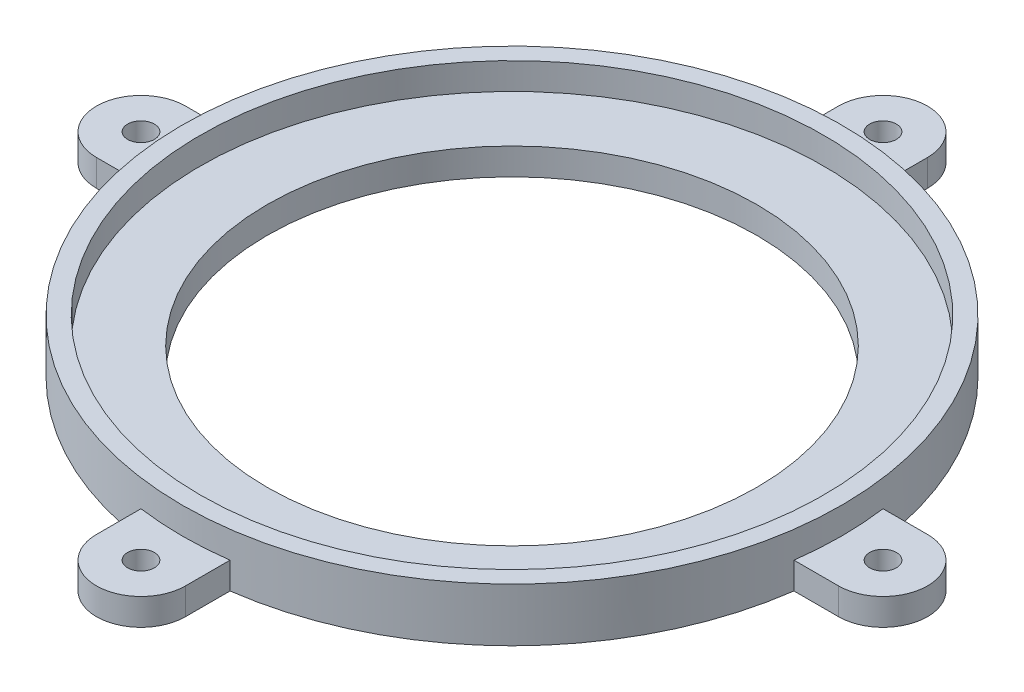
ISO-10303-21;
HEADER;
FILE_DESCRIPTION(('STEP AP214'),'2;1');
FILE_NAME('part.step','',(''),(''),'','','');
FILE_SCHEMA(('AUTOMOTIVE_DESIGN { 1 0 10303 214 1 1 1 1 }'));
ENDSEC;
DATA;
#1=APPLICATION_CONTEXT('core data for automotive mechanical design processes');
#2=APPLICATION_PROTOCOL_DEFINITION('international standard','automotive_design',2000,#1);
#3=PRODUCT_CONTEXT('',#1,'mechanical');
#4=PRODUCT('Part','Part','',(#3));
#5=PRODUCT_RELATED_PRODUCT_CATEGORY('part','',(#4));
#6=PRODUCT_DEFINITION_FORMATION('','',#4);
#7=PRODUCT_DEFINITION_CONTEXT('part definition',#1,'design');
#8=PRODUCT_DEFINITION('design','',#6,#7);
#9=PRODUCT_DEFINITION_SHAPE('','',#8);
#10=(LENGTH_UNIT() NAMED_UNIT(*) SI_UNIT(.MILLI.,.METRE.));
#11=(NAMED_UNIT(*) PLANE_ANGLE_UNIT() SI_UNIT($,.RADIAN.));
#12=(NAMED_UNIT(*) SI_UNIT($,.STERADIAN.) SOLID_ANGLE_UNIT());
#13=UNCERTAINTY_MEASURE_WITH_UNIT(LENGTH_MEASURE(1.E-05),#10,'distance_accuracy_value','');
#14=(GEOMETRIC_REPRESENTATION_CONTEXT(3) GLOBAL_UNCERTAINTY_ASSIGNED_CONTEXT((#13)) GLOBAL_UNIT_ASSIGNED_CONTEXT((#10,
#11,#12)) REPRESENTATION_CONTEXT('',''));
#15=CARTESIAN_POINT('',(0.,0.,0.));
#16=DIRECTION('',(0.,0.,1.));
#17=DIRECTION('',(1.,0.,0.));
#18=AXIS2_PLACEMENT_3D('',#15,#16,#17);
#19=CARTESIAN_POINT('',(0.,3.81,0.));
#20=DIRECTION('',(0.,1.,0.));
#21=DIRECTION('',(0.,0.,1.));
#22=AXIS2_PLACEMENT_3D('',#19,#20,#21);
#23=PLANE('',#22);
#24=CARTESIAN_POINT('',(0.,3.81,0.));
#25=DIRECTION('',(0.,1.,0.));
#26=DIRECTION('',(0.,0.,1.));
#27=AXIS2_PLACEMENT_3D('',#24,#25,#26);
#28=CIRCLE('',#27,46.99);
#29=CARTESIAN_POINT('',(46.5589690607513,3.81,6.35));
#30=VERTEX_POINT('',#29);
#31=CARTESIAN_POINT('',(46.5589690607513,3.81,-6.35));
#32=VERTEX_POINT('',#31);
#33=EDGE_CURVE('E11',#30,#32,#28,.T.);
#34=ORIENTED_EDGE('',*,*,#33,.F.);
#35=DIRECTION('',(1.,0.,0.));
#36=VECTOR('',#35,1.);
#37=CARTESIAN_POINT('',(46.5589690607513,3.81,6.35));
#38=LINE('',#37,#36);
#39=CARTESIAN_POINT('',(52.9089690607513,3.81,6.35));
#40=VERTEX_POINT('',#39);
#41=EDGE_CURVE('E156',#30,#40,#38,.T.);
#42=ORIENTED_EDGE('',*,*,#41,.T.);
#43=CARTESIAN_POINT('',(52.9089690607513,3.81,0.));
#44=DIRECTION('',(0.,1.,0.));
#45=DIRECTION('',(0.,0.,-1.));
#46=AXIS2_PLACEMENT_3D('',#43,#44,#45);
#47=CIRCLE('',#46,6.35);
#48=CARTESIAN_POINT('',(52.9089690607513,3.81,-6.35));
#49=VERTEX_POINT('',#48);
#50=EDGE_CURVE('E160',#40,#49,#47,.T.);
#51=ORIENTED_EDGE('',*,*,#50,.T.);
#52=DIRECTION('',(-1.,0.,0.));
#53=VECTOR('',#52,1.);
#54=CARTESIAN_POINT('',(46.5589690607513,3.81,-6.35));
#55=LINE('',#54,#53);
#56=EDGE_CURVE('E54',#49,#32,#55,.T.);
#57=ORIENTED_EDGE('',*,*,#56,.T.);
#58=EDGE_LOOP('',(#34,#42,#51,#57));
#59=FACE_BOUND('',#58,.T.);
#60=CARTESIAN_POINT('',(52.9089690607513,3.81,0.));
#61=DIRECTION('',(0.,1.,0.));
#62=DIRECTION('',(0.,0.,1.));
#63=AXIS2_PLACEMENT_3D('',#60,#61,#62);
#64=CIRCLE('',#63,1.905);
#65=CARTESIAN_POINT('',(52.9089690607513,3.81,1.905));
#66=VERTEX_POINT('',#65);
#67=EDGE_CURVE('E184',#66,#66,#64,.T.);
#68=ORIENTED_EDGE('',*,*,#67,.F.);
#69=EDGE_LOOP('',(#68));
#70=FACE_BOUND('',#69,.T.);
#71=ADVANCED_FACE('F35',(#59,#70),#23,.T.);
#72=CARTESIAN_POINT('',(6.34999999999999,3.81,-46.5589690607513));
#73=VERTEX_POINT('',#72);
#74=CARTESIAN_POINT('',(-6.35,3.81,-46.5589690607513));
#75=VERTEX_POINT('',#74);
#76=EDGE_CURVE('E45',#73,#75,#28,.T.);
#77=ORIENTED_EDGE('',*,*,#76,.F.);
#78=DIRECTION('',(0.,0.,-1.));
#79=VECTOR('',#78,1.);
#80=CARTESIAN_POINT('',(6.34999999999999,3.81,-46.5589690607513));
#81=LINE('',#80,#79);
#82=CARTESIAN_POINT('',(6.34999999999999,3.81,-52.9089690607513));
#83=VERTEX_POINT('',#82);
#84=EDGE_CURVE('E211',#73,#83,#81,.T.);
#85=ORIENTED_EDGE('',*,*,#84,.T.);
#86=CARTESIAN_POINT('',(0.,3.81,-52.9089690607513));
#87=DIRECTION('',(0.,1.,0.));
#88=DIRECTION('',(0.,0.,-1.));
#89=AXIS2_PLACEMENT_3D('',#86,#87,#88);
#90=CIRCLE('',#89,6.35);
#91=CARTESIAN_POINT('',(-6.35000000000001,3.81,-52.9089690607513));
#92=VERTEX_POINT('',#91);
#93=EDGE_CURVE('E276',#83,#92,#90,.T.);
#94=ORIENTED_EDGE('',*,*,#93,.T.);
#95=DIRECTION('',(0.,0.,1.));
#96=VECTOR('',#95,1.);
#97=CARTESIAN_POINT('',(-6.35000000000001,3.81,-46.5589690607513));
#98=LINE('',#97,#96);
#99=EDGE_CURVE('E272',#92,#75,#98,.T.);
#100=ORIENTED_EDGE('',*,*,#99,.T.);
#101=EDGE_LOOP('',(#77,#85,#94,#100));
#102=FACE_BOUND('',#101,.T.);
#103=CARTESIAN_POINT('',(0.,3.81,-52.9089690607513));
#104=DIRECTION('',(0.,1.,0.));
#105=DIRECTION('',(0.,0.,1.));
#106=AXIS2_PLACEMENT_3D('',#103,#104,#105);
#107=CIRCLE('',#106,1.90499999999984);
#108=CARTESIAN_POINT('',(0.,3.81,-51.0039690607515));
#109=VERTEX_POINT('',#108);
#110=EDGE_CURVE('E376',#109,#109,#107,.T.);
#111=ORIENTED_EDGE('',*,*,#110,.F.);
#112=EDGE_LOOP('',(#111));
#113=FACE_BOUND('',#112,.T.);
#114=ADVANCED_FACE('F370',(#102,#113),#23,.T.);
#115=CARTESIAN_POINT('',(-46.5589690607513,3.81,-6.34999999999999));
#116=VERTEX_POINT('',#115);
#117=CARTESIAN_POINT('',(-46.5589690607513,3.81,6.35000000000002));
#118=VERTEX_POINT('',#117);
#119=EDGE_CURVE('E250',#116,#118,#28,.T.);
#120=ORIENTED_EDGE('',*,*,#119,.F.);
#121=DIRECTION('',(-1.,0.,0.));
#122=VECTOR('',#121,1.);
#123=CARTESIAN_POINT('',(-46.5589690607513,3.81,-6.34999999999999));
#124=LINE('',#123,#122);
#125=CARTESIAN_POINT('',(-52.9089690607513,3.81,-6.34999999999999));
#126=VERTEX_POINT('',#125);
#127=EDGE_CURVE('E270',#116,#126,#124,.T.);
#128=ORIENTED_EDGE('',*,*,#127,.T.);
#129=CARTESIAN_POINT('',(-52.9089690607513,3.81,0.));
#130=DIRECTION('',(0.,1.,0.));
#131=DIRECTION('',(0.,0.,-1.));
#132=AXIS2_PLACEMENT_3D('',#129,#130,#131);
#133=CIRCLE('',#132,6.35);
#134=CARTESIAN_POINT('',(-52.9089690607513,3.81,6.35000000000001));
#135=VERTEX_POINT('',#134);
#136=EDGE_CURVE('E259',#126,#135,#133,.T.);
#137=ORIENTED_EDGE('',*,*,#136,.T.);
#138=DIRECTION('',(1.,0.,0.));
#139=VECTOR('',#138,1.);
#140=CARTESIAN_POINT('',(-46.5589690607513,3.81,6.35000000000001));
#141=LINE('',#140,#139);
#142=EDGE_CURVE('E256',#135,#118,#141,.T.);
#143=ORIENTED_EDGE('',*,*,#142,.T.);
#144=EDGE_LOOP('',(#120,#128,#137,#143));
#145=FACE_BOUND('',#144,.T.);
#146=CARTESIAN_POINT('',(-52.9089690607513,3.81,0.));
#147=DIRECTION('',(0.,1.,0.));
#148=DIRECTION('',(0.,0.,1.));
#149=AXIS2_PLACEMENT_3D('',#146,#147,#148);
#150=CIRCLE('',#149,1.90500000000001);
#151=CARTESIAN_POINT('',(-52.9089690607513,3.81,1.90500000000001));
#152=VERTEX_POINT('',#151);
#153=EDGE_CURVE('E382',#152,#152,#150,.T.);
#154=ORIENTED_EDGE('',*,*,#153,.F.);
#155=EDGE_LOOP('',(#154));
#156=FACE_BOUND('',#155,.T.);
#157=ADVANCED_FACE('F351',(#145,#156),#23,.T.);
#158=CARTESIAN_POINT('',(0.,3.81,0.));
#159=DIRECTION('',(0.,1.,0.));
#160=DIRECTION('',(0.,0.,1.));
#161=AXIS2_PLACEMENT_3D('',#158,#159,#160);
#162=CIRCLE('',#161,34.925);
#163=CARTESIAN_POINT('',(0.,3.81,34.925));
#164=VERTEX_POINT('',#163);
#165=EDGE_CURVE('E388',#164,#164,#162,.T.);
#166=ORIENTED_EDGE('',*,*,#165,.F.);
#167=EDGE_LOOP('',(#166));
#168=FACE_BOUND('',#167,.T.);
#169=CARTESIAN_POINT('',(0.,3.81,0.));
#170=DIRECTION('',(0.,1.,0.));
#171=DIRECTION('',(0.,0.,1.));
#172=AXIS2_PLACEMENT_3D('',#169,#170,#171);
#173=CIRCLE('',#172,44.45);
#174=CARTESIAN_POINT('',(0.,3.81,44.45));
#175=VERTEX_POINT('',#174);
#176=EDGE_CURVE('E441',#175,#175,#173,.T.);
#177=ORIENTED_EDGE('',*,*,#176,.T.);
#178=EDGE_LOOP('',(#177));
#179=FACE_BOUND('',#178,.T.);
#180=ADVANCED_FACE('F425',(#168,#179),#23,.T.);
#181=CARTESIAN_POINT('',(-6.35,3.81,46.5589690607513));
#182=VERTEX_POINT('',#181);
#183=CARTESIAN_POINT('',(6.35,3.81,46.5589690607513));
#184=VERTEX_POINT('',#183);
#185=EDGE_CURVE('E246',#182,#184,#28,.T.);
#186=ORIENTED_EDGE('',*,*,#185,.F.);
#187=DIRECTION('',(0.,0.,1.));
#188=VECTOR('',#187,1.);
#189=CARTESIAN_POINT('',(-6.35,3.81,46.5589690607513));
#190=LINE('',#189,#188);
#191=CARTESIAN_POINT('',(-6.35,3.81,52.9089690607513));
#192=VERTEX_POINT('',#191);
#193=EDGE_CURVE('E258',#182,#192,#190,.T.);
#194=ORIENTED_EDGE('',*,*,#193,.T.);
#195=CARTESIAN_POINT('',(0.,3.81,52.9089690607513));
#196=DIRECTION('',(0.,1.,0.));
#197=DIRECTION('',(0.,0.,-1.));
#198=AXIS2_PLACEMENT_3D('',#195,#196,#197);
#199=CIRCLE('',#198,6.35);
#200=CARTESIAN_POINT('',(6.35,3.81,52.9089690607513));
#201=VERTEX_POINT('',#200);
#202=EDGE_CURVE('E178',#192,#201,#199,.T.);
#203=ORIENTED_EDGE('',*,*,#202,.T.);
#204=DIRECTION('',(0.,0.,-1.));
#205=VECTOR('',#204,1.);
#206=CARTESIAN_POINT('',(6.35,3.81,46.5589690607513));
#207=LINE('',#206,#205);
#208=EDGE_CURVE('E164',#201,#184,#207,.T.);
#209=ORIENTED_EDGE('',*,*,#208,.T.);
#210=EDGE_LOOP('',(#186,#194,#203,#209));
#211=FACE_BOUND('',#210,.T.);
#212=CARTESIAN_POINT('',(0.,3.81,52.9089690607513));
#213=DIRECTION('',(0.,1.,0.));
#214=DIRECTION('',(0.,0.,1.));
#215=AXIS2_PLACEMENT_3D('',#212,#213,#214);
#216=CIRCLE('',#215,1.905);
#217=CARTESIAN_POINT('',(0.,3.81,54.8139690607513));
#218=VERTEX_POINT('',#217);
#219=EDGE_CURVE('E394',#218,#218,#216,.T.);
#220=ORIENTED_EDGE('',*,*,#219,.F.);
#221=EDGE_LOOP('',(#220));
#222=FACE_BOUND('',#221,.T.);
#223=ADVANCED_FACE('F302',(#211,#222),#23,.T.);
#224=CARTESIAN_POINT('',(0.,0.,0.));
#225=DIRECTION('',(0.,1.,0.));
#226=DIRECTION('',(0.,0.,1.));
#227=AXIS2_PLACEMENT_3D('',#224,#225,#226);
#228=PLANE('',#227);
#229=CARTESIAN_POINT('',(0.,0.,0.));
#230=DIRECTION('',(0.,1.,0.));
#231=DIRECTION('',(0.,0.,1.));
#232=AXIS2_PLACEMENT_3D('',#229,#230,#231);
#233=CIRCLE('',#232,34.925);
#234=CARTESIAN_POINT('',(0.,0.,34.925));
#235=VERTEX_POINT('',#234);
#236=EDGE_CURVE('E385',#235,#235,#233,.T.);
#237=ORIENTED_EDGE('',*,*,#236,.T.);
#238=EDGE_LOOP('',(#237));
#239=FACE_BOUND('',#238,.T.);
#240=CARTESIAN_POINT('',(0.,0.,0.));
#241=DIRECTION('',(0.,1.,0.));
#242=DIRECTION('',(0.,0.,1.));
#243=AXIS2_PLACEMENT_3D('',#240,#241,#242);
#244=CIRCLE('',#243,46.99);
#245=CARTESIAN_POINT('',(46.5589690607513,0.,-6.35));
#246=VERTEX_POINT('',#245);
#247=CARTESIAN_POINT('',(6.34999999999999,0.,-46.5589690607513));
#248=VERTEX_POINT('',#247);
#249=EDGE_CURVE('E180',#246,#248,#244,.T.);
#250=ORIENTED_EDGE('',*,*,#249,.F.);
#251=DIRECTION('',(-1.,0.,0.));
#252=VECTOR('',#251,1.);
#253=CARTESIAN_POINT('',(46.5589690607513,0.,-6.35));
#254=LINE('',#253,#252);
#255=CARTESIAN_POINT('',(52.9089690607513,0.,-6.35));
#256=VERTEX_POINT('',#255);
#257=EDGE_CURVE('E114',#256,#246,#254,.T.);
#258=ORIENTED_EDGE('',*,*,#257,.F.);
#259=CARTESIAN_POINT('',(52.9089690607513,0.,0.));
#260=DIRECTION('',(0.,1.,0.));
#261=DIRECTION('',(0.,0.,-1.));
#262=AXIS2_PLACEMENT_3D('',#259,#260,#261);
#263=CIRCLE('',#262,6.35);
#264=CARTESIAN_POINT('',(52.9089690607513,0.,6.35));
#265=VERTEX_POINT('',#264);
#266=EDGE_CURVE('E108',#265,#256,#263,.T.);
#267=ORIENTED_EDGE('',*,*,#266,.F.);
#268=DIRECTION('',(1.,0.,0.));
#269=VECTOR('',#268,1.);
#270=CARTESIAN_POINT('',(46.5589690607513,0.,6.35));
#271=LINE('',#270,#269);
#272=CARTESIAN_POINT('',(46.5589690607513,0.,6.35));
#273=VERTEX_POINT('',#272);
#274=EDGE_CURVE('E168',#273,#265,#271,.T.);
#275=ORIENTED_EDGE('',*,*,#274,.F.);
#276=CARTESIAN_POINT('',(0.,0.,0.));
#277=DIRECTION('',(0.,1.,0.));
#278=DIRECTION('',(0.,0.,1.));
#279=AXIS2_PLACEMENT_3D('',#276,#277,#278);
#280=CIRCLE('',#279,46.99);
#281=CARTESIAN_POINT('',(6.35,0.,46.5589690607513));
#282=VERTEX_POINT('',#281);
#283=EDGE_CURVE('E206',#282,#273,#280,.T.);
#284=ORIENTED_EDGE('',*,*,#283,.F.);
#285=DIRECTION('',(0.,0.,-1.));
#286=VECTOR('',#285,1.);
#287=CARTESIAN_POINT('',(6.35,0.,46.5589690607513));
#288=LINE('',#287,#286);
#289=CARTESIAN_POINT('',(6.35,0.,52.9089690607513));
#290=VERTEX_POINT('',#289);
#291=EDGE_CURVE('E204',#290,#282,#288,.T.);
#292=ORIENTED_EDGE('',*,*,#291,.F.);
#293=CARTESIAN_POINT('',(0.,0.,52.9089690607513));
#294=DIRECTION('',(0.,1.,0.));
#295=DIRECTION('',(0.,0.,-1.));
#296=AXIS2_PLACEMENT_3D('',#293,#294,#295);
#297=CIRCLE('',#296,6.35);
#298=CARTESIAN_POINT('',(-6.35,0.,52.9089690607513));
#299=VERTEX_POINT('',#298);
#300=EDGE_CURVE('E202',#299,#290,#297,.T.);
#301=ORIENTED_EDGE('',*,*,#300,.F.);
#302=DIRECTION('',(0.,0.,1.));
#303=VECTOR('',#302,1.);
#304=CARTESIAN_POINT('',(-6.35,0.,46.5589690607513));
#305=LINE('',#304,#303);
#306=CARTESIAN_POINT('',(-6.35,0.,46.5589690607513));
#307=VERTEX_POINT('',#306);
#308=EDGE_CURVE('E200',#307,#299,#305,.T.);
#309=ORIENTED_EDGE('',*,*,#308,.F.);
#310=CARTESIAN_POINT('',(0.,0.,0.));
#311=DIRECTION('',(0.,1.,0.));
#312=DIRECTION('',(0.,0.,1.));
#313=AXIS2_PLACEMENT_3D('',#310,#311,#312);
#314=CIRCLE('',#313,46.99);
#315=CARTESIAN_POINT('',(-46.5589690607513,0.,6.35000000000002));
#316=VERTEX_POINT('',#315);
#317=EDGE_CURVE('E198',#316,#307,#314,.T.);
#318=ORIENTED_EDGE('',*,*,#317,.F.);
#319=DIRECTION('',(1.,0.,0.));
#320=VECTOR('',#319,1.);
#321=CARTESIAN_POINT('',(-46.5589690607513,0.,6.35000000000001));
#322=LINE('',#321,#320);
#323=CARTESIAN_POINT('',(-52.9089690607513,0.,6.35000000000001));
#324=VERTEX_POINT('',#323);
#325=EDGE_CURVE('E196',#324,#316,#322,.T.);
#326=ORIENTED_EDGE('',*,*,#325,.F.);
#327=CARTESIAN_POINT('',(-52.9089690607513,0.,0.));
#328=DIRECTION('',(0.,1.,0.));
#329=DIRECTION('',(0.,0.,-1.));
#330=AXIS2_PLACEMENT_3D('',#327,#328,#329);
#331=CIRCLE('',#330,6.35);
#332=CARTESIAN_POINT('',(-52.9089690607513,0.,-6.34999999999999));
#333=VERTEX_POINT('',#332);
#334=EDGE_CURVE('E194',#333,#324,#331,.T.);
#335=ORIENTED_EDGE('',*,*,#334,.F.);
#336=DIRECTION('',(-1.,0.,0.));
#337=VECTOR('',#336,1.);
#338=CARTESIAN_POINT('',(-46.5589690607513,0.,-6.34999999999999));
#339=LINE('',#338,#337);
#340=CARTESIAN_POINT('',(-46.5589690607513,0.,-6.34999999999999));
#341=VERTEX_POINT('',#340);
#342=EDGE_CURVE('E192',#341,#333,#339,.T.);
#343=ORIENTED_EDGE('',*,*,#342,.F.);
#344=CARTESIAN_POINT('',(0.,0.,0.));
#345=DIRECTION('',(0.,1.,0.));
#346=DIRECTION('',(0.,0.,1.));
#347=AXIS2_PLACEMENT_3D('',#344,#345,#346);
#348=CIRCLE('',#347,46.99);
#349=CARTESIAN_POINT('',(-6.35,0.,-46.5589690607513));
#350=VERTEX_POINT('',#349);
#351=EDGE_CURVE('E190',#350,#341,#348,.T.);
#352=ORIENTED_EDGE('',*,*,#351,.F.);
#353=DIRECTION('',(0.,0.,1.));
#354=VECTOR('',#353,1.);
#355=CARTESIAN_POINT('',(-6.35000000000001,0.,-46.5589690607513));
#356=LINE('',#355,#354);
#357=CARTESIAN_POINT('',(-6.35000000000001,0.,-52.9089690607513));
#358=VERTEX_POINT('',#357);
#359=EDGE_CURVE('E188',#358,#350,#356,.T.);
#360=ORIENTED_EDGE('',*,*,#359,.F.);
#361=CARTESIAN_POINT('',(0.,0.,-52.9089690607513));
#362=DIRECTION('',(0.,1.,0.));
#363=DIRECTION('',(0.,0.,-1.));
#364=AXIS2_PLACEMENT_3D('',#361,#362,#363);
#365=CIRCLE('',#364,6.35);
#366=CARTESIAN_POINT('',(6.34999999999999,0.,-52.9089690607513));
#367=VERTEX_POINT('',#366);
#368=EDGE_CURVE('E186',#367,#358,#365,.T.);
#369=ORIENTED_EDGE('',*,*,#368,.F.);
#370=DIRECTION('',(0.,0.,-1.));
#371=VECTOR('',#370,1.);
#372=CARTESIAN_POINT('',(6.34999999999999,0.,-46.5589690607513));
#373=LINE('',#372,#371);
#374=EDGE_CURVE('E183',#248,#367,#373,.T.);
#375=ORIENTED_EDGE('',*,*,#374,.F.);
#376=EDGE_LOOP('',(#250,#258,#267,#275,#284,#292,#301,#309,#318,#326,#335,#343,#352,#360,#369,#375));
#377=FACE_BOUND('',#376,.T.);
#378=CARTESIAN_POINT('',(52.9089690607513,0.,0.));
#379=DIRECTION('',(0.,1.,0.));
#380=DIRECTION('',(0.,0.,1.));
#381=AXIS2_PLACEMENT_3D('',#378,#379,#380);
#382=CIRCLE('',#381,1.905);
#383=CARTESIAN_POINT('',(52.9089690607513,0.,1.905));
#384=VERTEX_POINT('',#383);
#385=EDGE_CURVE('E346',#384,#384,#382,.T.);
#386=ORIENTED_EDGE('',*,*,#385,.T.);
#387=EDGE_LOOP('',(#386));
#388=FACE_BOUND('',#387,.T.);
#389=CARTESIAN_POINT('',(0.,0.,52.9089690607513));
#390=DIRECTION('',(0.,1.,0.));
#391=DIRECTION('',(0.,0.,1.));
#392=AXIS2_PLACEMENT_3D('',#389,#390,#391);
#393=CIRCLE('',#392,1.905);
#394=CARTESIAN_POINT('',(0.,0.,54.8139690607513));
#395=VERTEX_POINT('',#394);
#396=EDGE_CURVE('E392',#395,#395,#393,.T.);
#397=ORIENTED_EDGE('',*,*,#396,.T.);
#398=EDGE_LOOP('',(#397));
#399=FACE_BOUND('',#398,.T.);
#400=CARTESIAN_POINT('',(-52.9089690607513,0.,0.));
#401=DIRECTION('',(0.,1.,0.));
#402=DIRECTION('',(0.,0.,1.));
#403=AXIS2_PLACEMENT_3D('',#400,#401,#402);
#404=CIRCLE('',#403,1.90500000000001);
#405=CARTESIAN_POINT('',(-52.9089690607513,0.,1.90500000000001));
#406=VERTEX_POINT('',#405);
#407=EDGE_CURVE('E378',#406,#406,#404,.T.);
#408=ORIENTED_EDGE('',*,*,#407,.T.);
#409=EDGE_LOOP('',(#408));
#410=FACE_BOUND('',#409,.T.);
#411=CARTESIAN_POINT('',(0.,0.,-52.9089690607513));
#412=DIRECTION('',(0.,1.,0.));
#413=DIRECTION('',(0.,0.,1.));
#414=AXIS2_PLACEMENT_3D('',#411,#412,#413);
#415=CIRCLE('',#414,1.90499999999984);
#416=CARTESIAN_POINT('',(0.,0.,-51.0039690607515));
#417=VERTEX_POINT('',#416);
#418=EDGE_CURVE('E379',#417,#417,#415,.T.);
#419=ORIENTED_EDGE('',*,*,#418,.T.);
#420=EDGE_LOOP('',(#419));
#421=FACE_BOUND('',#420,.T.);
#422=ADVANCED_FACE('F321',(#239,#377,#388,#399,#410,#421),#228,.F.);
#423=CARTESIAN_POINT('',(6.34999999999999,3.81,-46.5589690607513));
#424=DIRECTION('',(-1.,0.,0.));
#425=DIRECTION('',(0.,0.,1.));
#426=AXIS2_PLACEMENT_3D('',#423,#424,#425);
#427=PLANE('',#426);
#428=ORIENTED_EDGE('',*,*,#374,.T.);
#429=DIRECTION('',(0.,-1.,0.));
#430=VECTOR('',#429,1.);
#431=CARTESIAN_POINT('',(6.34999999999999,3.81,-52.9089690607513));
#432=LINE('',#431,#430);
#433=EDGE_CURVE('E232',#83,#367,#432,.T.);
#434=ORIENTED_EDGE('',*,*,#433,.F.);
#435=ORIENTED_EDGE('',*,*,#84,.F.);
#436=DIRECTION('',(0.,-1.,0.));
#437=VECTOR('',#436,1.);
#438=CARTESIAN_POINT('',(6.34999999999999,3.81,-46.5589690607513));
#439=LINE('',#438,#437);
#440=EDGE_CURVE('E236',#73,#248,#439,.T.);
#441=ORIENTED_EDGE('',*,*,#440,.T.);
#442=EDGE_LOOP('',(#428,#434,#435,#441));
#443=FACE_BOUND('',#442,.T.);
#444=ADVANCED_FACE('F37',(#443),#427,.F.);
#445=CARTESIAN_POINT('',(0.,3.81,-52.9089690607513));
#446=DIRECTION('',(0.,-1.,0.));
#447=DIRECTION('',(0.,0.,-1.));
#448=AXIS2_PLACEMENT_3D('',#445,#446,#447);
#449=CYLINDRICAL_SURFACE('',#448,6.35);
#450=ORIENTED_EDGE('',*,*,#368,.T.);
#451=DIRECTION('',(0.,-1.,0.));
#452=VECTOR('',#451,1.);
#453=CARTESIAN_POINT('',(-6.35000000000001,3.81,-52.9089690607513));
#454=LINE('',#453,#452);
#455=EDGE_CURVE('E229',#92,#358,#454,.T.);
#456=ORIENTED_EDGE('',*,*,#455,.F.);
#457=ORIENTED_EDGE('',*,*,#93,.F.);
#458=ORIENTED_EDGE('',*,*,#433,.T.);
#459=EDGE_LOOP('',(#450,#456,#457,#458));
#460=FACE_BOUND('',#459,.T.);
#461=ADVANCED_FACE('F341',(#460),#449,.T.);
#462=CARTESIAN_POINT('',(-6.35000000000001,3.81,-46.5589690607513));
#463=DIRECTION('',(1.,0.,0.));
#464=DIRECTION('',(0.,0.,-1.));
#465=AXIS2_PLACEMENT_3D('',#462,#463,#464);
#466=PLANE('',#465);
#467=ORIENTED_EDGE('',*,*,#359,.T.);
#468=DIRECTION('',(0.,-1.,0.));
#469=VECTOR('',#468,1.);
#470=CARTESIAN_POINT('',(-6.35,3.81,-46.5589690607513));
#471=LINE('',#470,#469);
#472=EDGE_CURVE('E233',#75,#350,#471,.T.);
#473=ORIENTED_EDGE('',*,*,#472,.F.);
#474=ORIENTED_EDGE('',*,*,#99,.F.);
#475=ORIENTED_EDGE('',*,*,#455,.T.);
#476=EDGE_LOOP('',(#467,#473,#474,#475));
#477=FACE_BOUND('',#476,.T.);
#478=ADVANCED_FACE('F369',(#477),#466,.F.);
#479=CARTESIAN_POINT('',(-46.5589690607513,3.81,-6.34999999999999));
#480=DIRECTION('',(0.,0.,1.));
#481=DIRECTION('',(1.,0.,0.));
#482=AXIS2_PLACEMENT_3D('',#479,#480,#481);
#483=PLANE('',#482);
#484=ORIENTED_EDGE('',*,*,#342,.T.);
#485=DIRECTION('',(0.,-1.,0.));
#486=VECTOR('',#485,1.);
#487=CARTESIAN_POINT('',(-52.9089690607513,3.81,-6.34999999999999));
#488=LINE('',#487,#486);
#489=EDGE_CURVE('E224',#126,#333,#488,.T.);
#490=ORIENTED_EDGE('',*,*,#489,.F.);
#491=ORIENTED_EDGE('',*,*,#127,.F.);
#492=DIRECTION('',(0.,-1.,0.));
#493=VECTOR('',#492,1.);
#494=CARTESIAN_POINT('',(-46.5589690607513,3.81,-6.34999999999999));
#495=LINE('',#494,#493);
#496=EDGE_CURVE('E228',#116,#341,#495,.T.);
#497=ORIENTED_EDGE('',*,*,#496,.T.);
#498=EDGE_LOOP('',(#484,#490,#491,#497));
#499=FACE_BOUND('',#498,.T.);
#500=ADVANCED_FACE('F366',(#499),#483,.F.);
#501=CARTESIAN_POINT('',(-52.9089690607513,3.81,0.));
#502=DIRECTION('',(0.,-1.,0.));
#503=DIRECTION('',(0.,0.,-1.));
#504=AXIS2_PLACEMENT_3D('',#501,#502,#503);
#505=CYLINDRICAL_SURFACE('',#504,6.35);
#506=ORIENTED_EDGE('',*,*,#334,.T.);
#507=DIRECTION('',(0.,-1.,0.));
#508=VECTOR('',#507,1.);
#509=CARTESIAN_POINT('',(-52.9089690607513,3.81,6.35000000000001));
#510=LINE('',#509,#508);
#511=EDGE_CURVE('E221',#135,#324,#510,.T.);
#512=ORIENTED_EDGE('',*,*,#511,.F.);
#513=ORIENTED_EDGE('',*,*,#136,.F.);
#514=ORIENTED_EDGE('',*,*,#489,.T.);
#515=EDGE_LOOP('',(#506,#512,#513,#514));
#516=FACE_BOUND('',#515,.T.);
#517=ADVANCED_FACE('F358',(#516),#505,.T.);
#518=CARTESIAN_POINT('',(-46.5589690607513,3.81,6.35000000000001));
#519=DIRECTION('',(0.,0.,-1.));
#520=DIRECTION('',(-1.,0.,0.));
#521=AXIS2_PLACEMENT_3D('',#518,#519,#520);
#522=PLANE('',#521);
#523=ORIENTED_EDGE('',*,*,#325,.T.);
#524=DIRECTION('',(0.,-1.,0.));
#525=VECTOR('',#524,1.);
#526=CARTESIAN_POINT('',(-46.5589690607513,3.81,6.35000000000002));
#527=LINE('',#526,#525);
#528=EDGE_CURVE('E225',#118,#316,#527,.T.);
#529=ORIENTED_EDGE('',*,*,#528,.F.);
#530=ORIENTED_EDGE('',*,*,#142,.F.);
#531=ORIENTED_EDGE('',*,*,#511,.T.);
#532=EDGE_LOOP('',(#523,#529,#530,#531));
#533=FACE_BOUND('',#532,.T.);
#534=ADVANCED_FACE('F361',(#533),#522,.F.);
#535=CARTESIAN_POINT('',(-6.35,3.81,46.5589690607513));
#536=DIRECTION('',(1.,0.,0.));
#537=DIRECTION('',(0.,0.,-1.));
#538=AXIS2_PLACEMENT_3D('',#535,#536,#537);
#539=PLANE('',#538);
#540=ORIENTED_EDGE('',*,*,#308,.T.);
#541=DIRECTION('',(0.,-1.,0.));
#542=VECTOR('',#541,1.);
#543=CARTESIAN_POINT('',(-6.35,3.81,52.9089690607513));
#544=LINE('',#543,#542);
#545=EDGE_CURVE('E216',#192,#299,#544,.T.);
#546=ORIENTED_EDGE('',*,*,#545,.F.);
#547=ORIENTED_EDGE('',*,*,#193,.F.);
#548=DIRECTION('',(0.,-1.,0.));
#549=VECTOR('',#548,1.);
#550=CARTESIAN_POINT('',(-6.35,3.81,46.5589690607513));
#551=LINE('',#550,#549);
#552=EDGE_CURVE('E220',#182,#307,#551,.T.);
#553=ORIENTED_EDGE('',*,*,#552,.T.);
#554=EDGE_LOOP('',(#540,#546,#547,#553));
#555=FACE_BOUND('',#554,.T.);
#556=ADVANCED_FACE('F316',(#555),#539,.F.);
#557=CARTESIAN_POINT('',(0.,3.81,52.9089690607513));
#558=DIRECTION('',(0.,-1.,0.));
#559=DIRECTION('',(0.,0.,-1.));
#560=AXIS2_PLACEMENT_3D('',#557,#558,#559);
#561=CYLINDRICAL_SURFACE('',#560,6.35);
#562=ORIENTED_EDGE('',*,*,#300,.T.);
#563=DIRECTION('',(0.,-1.,0.));
#564=VECTOR('',#563,1.);
#565=CARTESIAN_POINT('',(6.35,3.81,52.9089690607513));
#566=LINE('',#565,#564);
#567=EDGE_CURVE('E213',#201,#290,#566,.T.);
#568=ORIENTED_EDGE('',*,*,#567,.F.);
#569=ORIENTED_EDGE('',*,*,#202,.F.);
#570=ORIENTED_EDGE('',*,*,#545,.T.);
#571=EDGE_LOOP('',(#562,#568,#569,#570));
#572=FACE_BOUND('',#571,.T.);
#573=ADVANCED_FACE('F326',(#572),#561,.T.);
#574=CARTESIAN_POINT('',(6.35,3.81,46.5589690607513));
#575=DIRECTION('',(-1.,0.,0.));
#576=DIRECTION('',(0.,0.,1.));
#577=AXIS2_PLACEMENT_3D('',#574,#575,#576);
#578=PLANE('',#577);
#579=ORIENTED_EDGE('',*,*,#291,.T.);
#580=DIRECTION('',(0.,-1.,0.));
#581=VECTOR('',#580,1.);
#582=CARTESIAN_POINT('',(6.35,3.81,46.5589690607513));
#583=LINE('',#582,#581);
#584=EDGE_CURVE('E217',#184,#282,#583,.T.);
#585=ORIENTED_EDGE('',*,*,#584,.F.);
#586=ORIENTED_EDGE('',*,*,#208,.F.);
#587=ORIENTED_EDGE('',*,*,#567,.T.);
#588=EDGE_LOOP('',(#579,#585,#586,#587));
#589=FACE_BOUND('',#588,.T.);
#590=ADVANCED_FACE('F327',(#589),#578,.F.);
#591=CARTESIAN_POINT('',(0.,3.81,0.));
#592=DIRECTION('',(0.,-1.,0.));
#593=DIRECTION('',(0.,0.,-1.));
#594=AXIS2_PLACEMENT_3D('',#591,#592,#593);
#595=CYLINDRICAL_SURFACE('',#594,46.99);
#596=ORIENTED_EDGE('',*,*,#283,.T.);
#597=DIRECTION('',(0.,-1.,0.));
#598=VECTOR('',#597,1.);
#599=CARTESIAN_POINT('',(46.5589690607513,3.81,6.35));
#600=LINE('',#599,#598);
#601=EDGE_CURVE('E169',#30,#273,#600,.T.);
#602=ORIENTED_EDGE('',*,*,#601,.F.);
#603=ORIENTED_EDGE('',*,*,#33,.T.);
#604=DIRECTION('',(0.,-1.,0.));
#605=VECTOR('',#604,1.);
#606=CARTESIAN_POINT('',(46.5589690607513,3.81,-6.35));
#607=LINE('',#606,#605);
#608=EDGE_CURVE('E174',#32,#246,#607,.T.);
#609=ORIENTED_EDGE('',*,*,#608,.T.);
#610=ORIENTED_EDGE('',*,*,#249,.T.);
#611=ORIENTED_EDGE('',*,*,#440,.F.);
#612=ORIENTED_EDGE('',*,*,#76,.T.);
#613=ORIENTED_EDGE('',*,*,#472,.T.);
#614=ORIENTED_EDGE('',*,*,#351,.T.);
#615=ORIENTED_EDGE('',*,*,#496,.F.);
#616=ORIENTED_EDGE('',*,*,#119,.T.);
#617=ORIENTED_EDGE('',*,*,#528,.T.);
#618=ORIENTED_EDGE('',*,*,#317,.T.);
#619=ORIENTED_EDGE('',*,*,#552,.F.);
#620=ORIENTED_EDGE('',*,*,#185,.T.);
#621=ORIENTED_EDGE('',*,*,#584,.T.);
#622=EDGE_LOOP('',(#596,#602,#603,#609,#610,#611,#612,#613,#614,#615,#616,#617,#618,#619,#620,#621));
#623=FACE_BOUND('',#622,.T.);
#624=CARTESIAN_POINT('',(0.,7.62,0.));
#625=DIRECTION('',(0.,1.,0.));
#626=DIRECTION('',(0.,0.,1.));
#627=AXIS2_PLACEMENT_3D('',#624,#625,#626);
#628=CIRCLE('',#627,46.99);
#629=CARTESIAN_POINT('',(0.,7.62,46.99));
#630=VERTEX_POINT('',#629);
#631=EDGE_CURVE('E446',#630,#630,#628,.T.);
#632=ORIENTED_EDGE('',*,*,#631,.F.);
#633=EDGE_LOOP('',(#632));
#634=FACE_BOUND('',#633,.T.);
#635=ADVANCED_FACE('F294',(#623,#634),#595,.T.);
#636=CARTESIAN_POINT('',(46.5589690607513,3.81,6.35));
#637=DIRECTION('',(0.,0.,-1.));
#638=DIRECTION('',(-1.,0.,0.));
#639=AXIS2_PLACEMENT_3D('',#636,#637,#638);
#640=PLANE('',#639);
#641=ORIENTED_EDGE('',*,*,#274,.T.);
#642=DIRECTION('',(0.,-1.,0.));
#643=VECTOR('',#642,1.);
#644=CARTESIAN_POINT('',(52.9089690607513,3.81,6.35));
#645=LINE('',#644,#643);
#646=EDGE_CURVE('E165',#40,#265,#645,.T.);
#647=ORIENTED_EDGE('',*,*,#646,.F.);
#648=ORIENTED_EDGE('',*,*,#41,.F.);
#649=ORIENTED_EDGE('',*,*,#601,.T.);
#650=EDGE_LOOP('',(#641,#647,#648,#649));
#651=FACE_BOUND('',#650,.T.);
#652=ADVANCED_FACE('F166',(#651),#640,.F.);
#653=CARTESIAN_POINT('',(52.9089690607513,3.81,0.));
#654=DIRECTION('',(0.,-1.,0.));
#655=DIRECTION('',(0.,0.,-1.));
#656=AXIS2_PLACEMENT_3D('',#653,#654,#655);
#657=CYLINDRICAL_SURFACE('',#656,6.35);
#658=ORIENTED_EDGE('',*,*,#266,.T.);
#659=DIRECTION('',(0.,-1.,0.));
#660=VECTOR('',#659,1.);
#661=CARTESIAN_POINT('',(52.9089690607513,3.81,-6.35));
#662=LINE('',#661,#660);
#663=EDGE_CURVE('E170',#49,#256,#662,.T.);
#664=ORIENTED_EDGE('',*,*,#663,.F.);
#665=ORIENTED_EDGE('',*,*,#50,.F.);
#666=ORIENTED_EDGE('',*,*,#646,.T.);
#667=EDGE_LOOP('',(#658,#664,#665,#666));
#668=FACE_BOUND('',#667,.T.);
#669=ADVANCED_FACE('F172',(#668),#657,.T.);
#670=CARTESIAN_POINT('',(46.5589690607513,3.81,-6.35));
#671=DIRECTION('',(0.,0.,1.));
#672=DIRECTION('',(1.,0.,0.));
#673=AXIS2_PLACEMENT_3D('',#670,#671,#672);
#674=PLANE('',#673);
#675=ORIENTED_EDGE('',*,*,#257,.T.);
#676=ORIENTED_EDGE('',*,*,#608,.F.);
#677=ORIENTED_EDGE('',*,*,#56,.F.);
#678=ORIENTED_EDGE('',*,*,#663,.T.);
#679=EDGE_LOOP('',(#675,#676,#677,#678));
#680=FACE_BOUND('',#679,.T.);
#681=ADVANCED_FACE('F408',(#680),#674,.F.);
#682=CARTESIAN_POINT('',(52.9089690607513,3.81,0.));
#683=DIRECTION('',(0.,-1.,0.));
#684=DIRECTION('',(0.,0.,-1.));
#685=AXIS2_PLACEMENT_3D('',#682,#683,#684);
#686=CYLINDRICAL_SURFACE('',#685,1.905);
#687=ORIENTED_EDGE('',*,*,#67,.T.);
#688=EDGE_LOOP('',(#687));
#689=FACE_BOUND('',#688,.T.);
#690=ORIENTED_EDGE('',*,*,#385,.F.);
#691=EDGE_LOOP('',(#690));
#692=FACE_BOUND('',#691,.T.);
#693=ADVANCED_FACE('F405',(#689,#692),#686,.F.);
#694=CARTESIAN_POINT('',(0.,3.81,52.9089690607513));
#695=DIRECTION('',(0.,-1.,0.));
#696=DIRECTION('',(0.,0.,-1.));
#697=AXIS2_PLACEMENT_3D('',#694,#695,#696);
#698=CYLINDRICAL_SURFACE('',#697,1.905);
#699=ORIENTED_EDGE('',*,*,#219,.T.);
#700=EDGE_LOOP('',(#699));
#701=FACE_BOUND('',#700,.T.);
#702=ORIENTED_EDGE('',*,*,#396,.F.);
#703=EDGE_LOOP('',(#702));
#704=FACE_BOUND('',#703,.T.);
#705=ADVANCED_FACE('F407',(#701,#704),#698,.F.);
#706=CARTESIAN_POINT('',(-52.9089690607513,3.81,0.));
#707=DIRECTION('',(0.,-1.,0.));
#708=DIRECTION('',(0.,0.,-1.));
#709=AXIS2_PLACEMENT_3D('',#706,#707,#708);
#710=CYLINDRICAL_SURFACE('',#709,1.90500000000001);
#711=ORIENTED_EDGE('',*,*,#153,.T.);
#712=EDGE_LOOP('',(#711));
#713=FACE_BOUND('',#712,.T.);
#714=ORIENTED_EDGE('',*,*,#407,.F.);
#715=EDGE_LOOP('',(#714));
#716=FACE_BOUND('',#715,.T.);
#717=ADVANCED_FACE('F414',(#713,#716),#710,.F.);
#718=CARTESIAN_POINT('',(0.,3.81,-52.9089690607513));
#719=DIRECTION('',(0.,-1.,0.));
#720=DIRECTION('',(0.,0.,-1.));
#721=AXIS2_PLACEMENT_3D('',#718,#719,#720);
#722=CYLINDRICAL_SURFACE('',#721,1.90499999999984);
#723=ORIENTED_EDGE('',*,*,#110,.T.);
#724=EDGE_LOOP('',(#723));
#725=FACE_BOUND('',#724,.T.);
#726=ORIENTED_EDGE('',*,*,#418,.F.);
#727=EDGE_LOOP('',(#726));
#728=FACE_BOUND('',#727,.T.);
#729=ADVANCED_FACE('F456',(#725,#728),#722,.F.);
#730=CARTESIAN_POINT('',(0.,0.,0.));
#731=DIRECTION('',(0.,1.,0.));
#732=DIRECTION('',(0.,0.,1.));
#733=AXIS2_PLACEMENT_3D('',#730,#731,#732);
#734=CYLINDRICAL_SURFACE('',#733,34.925);
#735=ORIENTED_EDGE('',*,*,#236,.F.);
#736=EDGE_LOOP('',(#735));
#737=FACE_BOUND('',#736,.T.);
#738=ORIENTED_EDGE('',*,*,#165,.T.);
#739=EDGE_LOOP('',(#738));
#740=FACE_BOUND('',#739,.T.);
#741=ADVANCED_FACE('F453',(#737,#740),#734,.F.);
#742=CARTESIAN_POINT('',(0.,7.62,0.));
#743=DIRECTION('',(0.,1.,0.));
#744=DIRECTION('',(0.,0.,1.));
#745=AXIS2_PLACEMENT_3D('',#742,#743,#744);
#746=PLANE('',#745);
#747=ORIENTED_EDGE('',*,*,#631,.T.);
#748=EDGE_LOOP('',(#747));
#749=FACE_BOUND('',#748,.T.);
#750=CARTESIAN_POINT('',(0.,7.62,0.));
#751=DIRECTION('',(0.,1.,0.));
#752=DIRECTION('',(0.,0.,1.));
#753=AXIS2_PLACEMENT_3D('',#750,#751,#752);
#754=CIRCLE('',#753,44.45);
#755=CARTESIAN_POINT('',(0.,7.62,44.45));
#756=VERTEX_POINT('',#755);
#757=EDGE_CURVE('E443',#756,#756,#754,.T.);
#758=ORIENTED_EDGE('',*,*,#757,.F.);
#759=EDGE_LOOP('',(#758));
#760=FACE_BOUND('',#759,.T.);
#761=ADVANCED_FACE('F455',(#749,#760),#746,.T.);
#762=CARTESIAN_POINT('',(0.,7.62,0.));
#763=DIRECTION('',(0.,-1.,0.));
#764=DIRECTION('',(0.,0.,-1.));
#765=AXIS2_PLACEMENT_3D('',#762,#763,#764);
#766=CYLINDRICAL_SURFACE('',#765,44.45);
#767=ORIENTED_EDGE('',*,*,#757,.T.);
#768=EDGE_LOOP('',(#767));
#769=FACE_BOUND('',#768,.T.);
#770=ORIENTED_EDGE('',*,*,#176,.F.);
#771=EDGE_LOOP('',(#770));
#772=FACE_BOUND('',#771,.T.);
#773=ADVANCED_FACE('F463',(#769,#772),#766,.F.);
#774=CLOSED_SHELL('',(#71,#114,#157,#180,#223,#422,#444,#461,#478,#500,#517,#534,#556,#573,#590,
#635,#652,#669,#681,#693,#705,#717,#729,#741,#761,#773));
#775=MANIFOLD_SOLID_BREP('B2',#774);
#776=ADVANCED_BREP_SHAPE_REPRESENTATION('',(#18,#775),#14);
#777=SHAPE_DEFINITION_REPRESENTATION(#9,#776);
ENDSEC;
END-ISO-10303-21;
